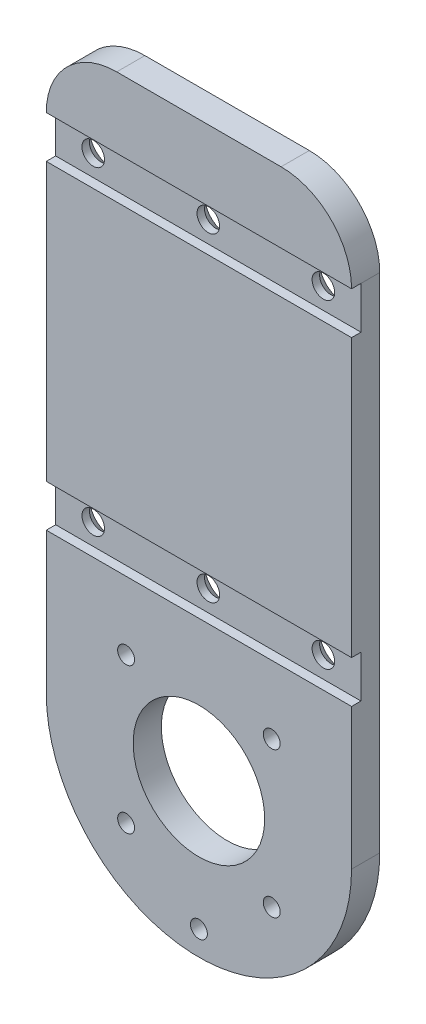
ISO-10303-21;
HEADER;
FILE_DESCRIPTION(('STEP AP214'),'2;1');
FILE_NAME('part.step','',(''),(''),'','','');
FILE_SCHEMA(('AUTOMOTIVE_DESIGN { 1 0 10303 214 1 1 1 1 }'));
ENDSEC;
DATA;
#1=APPLICATION_CONTEXT('core data for automotive mechanical design processes');
#2=APPLICATION_PROTOCOL_DEFINITION('international standard','automotive_design',2000,#1);
#3=PRODUCT_CONTEXT('',#1,'mechanical');
#4=PRODUCT('Part','Part','',(#3));
#5=PRODUCT_RELATED_PRODUCT_CATEGORY('part','',(#4));
#6=PRODUCT_DEFINITION_FORMATION('','',#4);
#7=PRODUCT_DEFINITION_CONTEXT('part definition',#1,'design');
#8=PRODUCT_DEFINITION('design','',#6,#7);
#9=PRODUCT_DEFINITION_SHAPE('','',#8);
#10=(LENGTH_UNIT() NAMED_UNIT(*) SI_UNIT(.MILLI.,.METRE.));
#11=(NAMED_UNIT(*) PLANE_ANGLE_UNIT() SI_UNIT($,.RADIAN.));
#12=(NAMED_UNIT(*) SI_UNIT($,.STERADIAN.) SOLID_ANGLE_UNIT());
#13=UNCERTAINTY_MEASURE_WITH_UNIT(LENGTH_MEASURE(1.E-05),#10,'distance_accuracy_value','');
#14=(GEOMETRIC_REPRESENTATION_CONTEXT(3) GLOBAL_UNCERTAINTY_ASSIGNED_CONTEXT((#13)) GLOBAL_UNIT_ASSIGNED_CONTEXT((#10,
#11,#12)) REPRESENTATION_CONTEXT('',''));
#15=CARTESIAN_POINT('',(0.,0.,0.));
#16=DIRECTION('',(0.,0.,1.));
#17=DIRECTION('',(1.,0.,0.));
#18=AXIS2_PLACEMENT_3D('',#15,#16,#17);
#19=CARTESIAN_POINT('',(32.5,0.,6.));
#20=DIRECTION('',(-1.,0.,0.));
#21=DIRECTION('',(0.,0.,1.));
#22=AXIS2_PLACEMENT_3D('',#19,#20,#21);
#23=PLANE('',#22);
#24=DIRECTION('',(0.,1.,0.));
#25=VECTOR('',#24,1.);
#26=CARTESIAN_POINT('',(32.5,0.,0.));
#27=LINE('',#26,#25);
#28=CARTESIAN_POINT('',(32.5,-95.,0.));
#29=VERTEX_POINT('',#28);
#30=CARTESIAN_POINT('',(32.5,12.,0.));
#31=VERTEX_POINT('',#30);
#32=EDGE_CURVE('E231',#29,#31,#27,.T.);
#33=ORIENTED_EDGE('',*,*,#32,.T.);
#34=DIRECTION('',(0.,0.,1.));
#35=VECTOR('',#34,1.);
#36=CARTESIAN_POINT('',(32.5,12.,6.));
#37=LINE('',#36,#35);
#38=CARTESIAN_POINT('',(32.5,12.,4.));
#39=VERTEX_POINT('',#38);
#40=EDGE_CURVE('E302',#31,#39,#37,.T.);
#41=ORIENTED_EDGE('',*,*,#40,.T.);
#42=DIRECTION('',(0.,1.,0.));
#43=VECTOR('',#42,1.);
#44=CARTESIAN_POINT('',(32.5,0.,4.));
#45=LINE('',#44,#43);
#46=CARTESIAN_POINT('',(32.5,2.99999999999998,4.));
#47=VERTEX_POINT('',#46);
#48=EDGE_CURVE('E153',#47,#39,#45,.T.);
#49=ORIENTED_EDGE('',*,*,#48,.F.);
#50=DIRECTION('',(0.,0.,1.));
#51=VECTOR('',#50,1.);
#52=CARTESIAN_POINT('',(32.5,2.99999999999998,4.));
#53=LINE('',#52,#51);
#54=CARTESIAN_POINT('',(32.5,2.99999999999998,6.));
#55=VERTEX_POINT('',#54);
#56=EDGE_CURVE('E149',#47,#55,#53,.T.);
#57=ORIENTED_EDGE('',*,*,#56,.T.);
#58=DIRECTION('',(0.,1.,0.));
#59=VECTOR('',#58,1.);
#60=CARTESIAN_POINT('',(32.5,0.,6.));
#61=LINE('',#60,#59);
#62=CARTESIAN_POINT('',(32.5,-56.,6.));
#63=VERTEX_POINT('',#62);
#64=EDGE_CURVE('E217',#63,#55,#61,.T.);
#65=ORIENTED_EDGE('',*,*,#64,.F.);
#66=DIRECTION('',(0.,0.,1.));
#67=VECTOR('',#66,1.);
#68=CARTESIAN_POINT('',(32.5,-56.,4.));
#69=LINE('',#68,#67);
#70=CARTESIAN_POINT('',(32.5,-56.,4.));
#71=VERTEX_POINT('',#70);
#72=EDGE_CURVE('E185',#71,#63,#69,.T.);
#73=ORIENTED_EDGE('',*,*,#72,.F.);
#74=DIRECTION('',(0.,1.,0.));
#75=VECTOR('',#74,1.);
#76=CARTESIAN_POINT('',(32.5,0.,4.));
#77=LINE('',#76,#75);
#78=CARTESIAN_POINT('',(32.5,-65.,4.));
#79=VERTEX_POINT('',#78);
#80=EDGE_CURVE('E173',#79,#71,#77,.T.);
#81=ORIENTED_EDGE('',*,*,#80,.F.);
#82=DIRECTION('',(0.,0.,1.));
#83=VECTOR('',#82,1.);
#84=CARTESIAN_POINT('',(32.5,-65.,4.));
#85=LINE('',#84,#83);
#86=CARTESIAN_POINT('',(32.5,-65.,6.));
#87=VERTEX_POINT('',#86);
#88=EDGE_CURVE('E191',#79,#87,#85,.T.);
#89=ORIENTED_EDGE('',*,*,#88,.T.);
#90=CARTESIAN_POINT('',(32.5,-95.,6.));
#91=VERTEX_POINT('',#90);
#92=EDGE_CURVE('E219',#91,#87,#61,.T.);
#93=ORIENTED_EDGE('',*,*,#92,.F.);
#94=DIRECTION('',(0.,0.,-1.));
#95=VECTOR('',#94,1.);
#96=CARTESIAN_POINT('',(32.5,-95.,6.));
#97=LINE('',#96,#95);
#98=EDGE_CURVE('E239',#91,#29,#97,.T.);
#99=ORIENTED_EDGE('',*,*,#98,.T.);
#100=EDGE_LOOP('',(#33,#41,#49,#57,#65,#73,#81,#89,#93,#99));
#101=FACE_BOUND('',#100,.T.);
#102=ADVANCED_FACE('F45',(#101),#23,.F.);
#103=CARTESIAN_POINT('',(-32.5,0.,6.));
#104=DIRECTION('',(-1.,0.,0.));
#105=DIRECTION('',(0.,0.,1.));
#106=AXIS2_PLACEMENT_3D('',#103,#104,#105);
#107=PLANE('',#106);
#108=DIRECTION('',(0.,-1.,0.));
#109=VECTOR('',#108,1.);
#110=CARTESIAN_POINT('',(-32.5,0.,4.));
#111=LINE('',#110,#109);
#112=CARTESIAN_POINT('',(-32.5,12.,4.));
#113=VERTEX_POINT('',#112);
#114=CARTESIAN_POINT('',(-32.5,2.99999999999998,4.));
#115=VERTEX_POINT('',#114);
#116=EDGE_CURVE('E154',#113,#115,#111,.T.);
#117=ORIENTED_EDGE('',*,*,#116,.F.);
#118=DIRECTION('',(0.,0.,1.));
#119=VECTOR('',#118,1.);
#120=CARTESIAN_POINT('',(-32.5,12.,0.));
#121=LINE('',#120,#119);
#122=CARTESIAN_POINT('',(-32.5,12.,0.));
#123=VERTEX_POINT('',#122);
#124=EDGE_CURVE('E11',#113,#123,#121,.F.);
#125=ORIENTED_EDGE('',*,*,#124,.T.);
#126=DIRECTION('',(0.,1.,0.));
#127=VECTOR('',#126,1.);
#128=CARTESIAN_POINT('',(-32.5,0.,0.));
#129=LINE('',#128,#127);
#130=CARTESIAN_POINT('',(-32.5,-95.,0.));
#131=VERTEX_POINT('',#130);
#132=EDGE_CURVE('E234',#131,#123,#129,.T.);
#133=ORIENTED_EDGE('',*,*,#132,.F.);
#134=DIRECTION('',(0.,0.,-1.));
#135=VECTOR('',#134,1.);
#136=CARTESIAN_POINT('',(-32.5,-95.,6.));
#137=LINE('',#136,#135);
#138=CARTESIAN_POINT('',(-32.5,-95.,6.));
#139=VERTEX_POINT('',#138);
#140=EDGE_CURVE('E228',#139,#131,#137,.T.);
#141=ORIENTED_EDGE('',*,*,#140,.F.);
#142=DIRECTION('',(0.,1.,0.));
#143=VECTOR('',#142,1.);
#144=CARTESIAN_POINT('',(-32.5,0.,6.));
#145=LINE('',#144,#143);
#146=CARTESIAN_POINT('',(-32.5,-65.,6.));
#147=VERTEX_POINT('',#146);
#148=EDGE_CURVE('E222',#139,#147,#145,.T.);
#149=ORIENTED_EDGE('',*,*,#148,.T.);
#150=DIRECTION('',(0.,0.,1.));
#151=VECTOR('',#150,1.);
#152=CARTESIAN_POINT('',(-32.5,-65.,4.));
#153=LINE('',#152,#151);
#154=CARTESIAN_POINT('',(-32.5,-65.,4.));
#155=VERTEX_POINT('',#154);
#156=EDGE_CURVE('E195',#155,#147,#153,.T.);
#157=ORIENTED_EDGE('',*,*,#156,.F.);
#158=DIRECTION('',(0.,-1.,0.));
#159=VECTOR('',#158,1.);
#160=CARTESIAN_POINT('',(-32.5,0.,4.));
#161=LINE('',#160,#159);
#162=CARTESIAN_POINT('',(-32.5,-56.,4.));
#163=VERTEX_POINT('',#162);
#164=EDGE_CURVE('E180',#163,#155,#161,.T.);
#165=ORIENTED_EDGE('',*,*,#164,.F.);
#166=DIRECTION('',(0.,0.,1.));
#167=VECTOR('',#166,1.);
#168=CARTESIAN_POINT('',(-32.5,-56.,4.));
#169=LINE('',#168,#167);
#170=CARTESIAN_POINT('',(-32.5,-56.,6.));
#171=VERTEX_POINT('',#170);
#172=EDGE_CURVE('E197',#163,#171,#169,.T.);
#173=ORIENTED_EDGE('',*,*,#172,.T.);
#174=CARTESIAN_POINT('',(-32.5,2.99999999999998,6.));
#175=VERTEX_POINT('',#174);
#176=EDGE_CURVE('E166',#171,#175,#145,.T.);
#177=ORIENTED_EDGE('',*,*,#176,.T.);
#178=DIRECTION('',(0.,0.,1.));
#179=VECTOR('',#178,1.);
#180=CARTESIAN_POINT('',(-32.5,2.99999999999998,4.));
#181=LINE('',#180,#179);
#182=EDGE_CURVE('E146',#115,#175,#181,.T.);
#183=ORIENTED_EDGE('',*,*,#182,.F.);
#184=EDGE_LOOP('',(#117,#125,#133,#141,#149,#157,#165,#173,#177,#183));
#185=FACE_BOUND('',#184,.T.);
#186=ADVANCED_FACE('F163',(#185),#107,.T.);
#187=CARTESIAN_POINT('',(0.,0.,6.));
#188=DIRECTION('',(0.,0.,1.));
#189=DIRECTION('',(1.,0.,0.));
#190=AXIS2_PLACEMENT_3D('',#187,#188,#189);
#191=PLANE('',#190);
#192=DIRECTION('',(1.,0.,0.));
#193=VECTOR('',#192,1.);
#194=CARTESIAN_POINT('',(0.,12.,6.));
#195=LINE('',#194,#193);
#196=CARTESIAN_POINT('',(-32.5,12.,6.));
#197=VERTEX_POINT('',#196);
#198=CARTESIAN_POINT('',(32.5,12.,6.));
#199=VERTEX_POINT('',#198);
#200=EDGE_CURVE('E160',#197,#199,#195,.T.);
#201=ORIENTED_EDGE('',*,*,#200,.T.);
#202=CARTESIAN_POINT('',(17.5,12.,6.));
#203=DIRECTION('',(0.,0.,1.));
#204=DIRECTION('',(1.,0.,0.));
#205=AXIS2_PLACEMENT_3D('',#202,#203,#204);
#206=CIRCLE('',#205,15.);
#207=CARTESIAN_POINT('',(17.5,27.,6.));
#208=VERTEX_POINT('',#207);
#209=EDGE_CURVE('E307',#199,#208,#206,.T.);
#210=ORIENTED_EDGE('',*,*,#209,.T.);
#211=DIRECTION('',(1.,0.,0.));
#212=VECTOR('',#211,1.);
#213=CARTESIAN_POINT('',(-32.5,27.,6.));
#214=LINE('',#213,#212);
#215=CARTESIAN_POINT('',(-17.5,27.,6.));
#216=VERTEX_POINT('',#215);
#217=EDGE_CURVE('E353',#216,#208,#214,.T.);
#218=ORIENTED_EDGE('',*,*,#217,.F.);
#219=CARTESIAN_POINT('',(-17.5,12.,6.));
#220=DIRECTION('',(0.,0.,1.));
#221=DIRECTION('',(1.,0.,0.));
#222=AXIS2_PLACEMENT_3D('',#219,#220,#221);
#223=CIRCLE('',#222,15.);
#224=EDGE_CURVE('E305',#216,#197,#223,.T.);
#225=ORIENTED_EDGE('',*,*,#224,.T.);
#226=EDGE_LOOP('',(#201,#210,#218,#225));
#227=FACE_BOUND('',#226,.T.);
#228=ADVANCED_FACE('F408',(#227),#191,.T.);
#229=CARTESIAN_POINT('',(0.,-122.3,6.));
#230=DIRECTION('',(0.,0.,1.));
#231=DIRECTION('',(1.,0.,0.));
#232=AXIS2_PLACEMENT_3D('',#229,#230,#231);
#233=CIRCLE('',#232,1.79999999999999);
#234=CARTESIAN_POINT('',(1.79999999999999,-122.3,6.));
#235=VERTEX_POINT('',#234);
#236=EDGE_CURVE('E49',#235,#235,#233,.T.);
#237=ORIENTED_EDGE('',*,*,#236,.F.);
#238=EDGE_LOOP('',(#237));
#239=FACE_BOUND('',#238,.T.);
#240=CARTESIAN_POINT('',(15.5,-110.5,6.));
#241=DIRECTION('',(0.,0.,-1.));
#242=DIRECTION('',(-1.,0.,0.));
#243=AXIS2_PLACEMENT_3D('',#240,#241,#242);
#244=CIRCLE('',#243,1.8);
#245=CARTESIAN_POINT('',(13.7,-110.5,6.));
#246=VERTEX_POINT('',#245);
#247=EDGE_CURVE('E200',#246,#246,#244,.T.);
#248=ORIENTED_EDGE('',*,*,#247,.T.);
#249=EDGE_LOOP('',(#248));
#250=FACE_BOUND('',#249,.T.);
#251=CARTESIAN_POINT('',(-15.5,-110.5,6.));
#252=DIRECTION('',(0.,0.,-1.));
#253=DIRECTION('',(-1.,0.,0.));
#254=AXIS2_PLACEMENT_3D('',#251,#252,#253);
#255=CIRCLE('',#254,1.8);
#256=CARTESIAN_POINT('',(-17.3,-110.5,6.));
#257=VERTEX_POINT('',#256);
#258=EDGE_CURVE('E203',#257,#257,#255,.T.);
#259=ORIENTED_EDGE('',*,*,#258,.T.);
#260=EDGE_LOOP('',(#259));
#261=FACE_BOUND('',#260,.T.);
#262=CARTESIAN_POINT('',(-15.5,-79.5,6.));
#263=DIRECTION('',(0.,0.,-1.));
#264=DIRECTION('',(-1.,0.,0.));
#265=AXIS2_PLACEMENT_3D('',#262,#263,#264);
#266=CIRCLE('',#265,1.8);
#267=CARTESIAN_POINT('',(-17.3,-79.5,6.));
#268=VERTEX_POINT('',#267);
#269=EDGE_CURVE('E207',#268,#268,#266,.T.);
#270=ORIENTED_EDGE('',*,*,#269,.T.);
#271=EDGE_LOOP('',(#270));
#272=FACE_BOUND('',#271,.T.);
#273=CARTESIAN_POINT('',(15.5,-79.5,6.));
#274=DIRECTION('',(0.,0.,-1.));
#275=DIRECTION('',(-1.,0.,0.));
#276=AXIS2_PLACEMENT_3D('',#273,#274,#275);
#277=CIRCLE('',#276,1.8);
#278=CARTESIAN_POINT('',(13.7,-79.5,6.));
#279=VERTEX_POINT('',#278);
#280=EDGE_CURVE('E210',#279,#279,#277,.T.);
#281=ORIENTED_EDGE('',*,*,#280,.T.);
#282=EDGE_LOOP('',(#281));
#283=FACE_BOUND('',#282,.T.);
#284=CARTESIAN_POINT('',(0.,-95.,6.));
#285=DIRECTION('',(0.,0.,1.));
#286=DIRECTION('',(1.,0.,0.));
#287=AXIS2_PLACEMENT_3D('',#284,#285,#286);
#288=CIRCLE('',#287,14.);
#289=CARTESIAN_POINT('',(14.,-95.,6.));
#290=VERTEX_POINT('',#289);
#291=EDGE_CURVE('E225',#290,#290,#288,.T.);
#292=ORIENTED_EDGE('',*,*,#291,.F.);
#293=EDGE_LOOP('',(#292));
#294=FACE_BOUND('',#293,.T.);
#295=ORIENTED_EDGE('',*,*,#92,.T.);
#296=DIRECTION('',(-1.,0.,0.));
#297=VECTOR('',#296,1.);
#298=CARTESIAN_POINT('',(0.,-65.,6.));
#299=LINE('',#298,#297);
#300=EDGE_CURVE('E177',#87,#147,#299,.T.);
#301=ORIENTED_EDGE('',*,*,#300,.T.);
#302=ORIENTED_EDGE('',*,*,#148,.F.);
#303=CARTESIAN_POINT('',(0.,-95.,6.));
#304=DIRECTION('',(0.,0.,1.));
#305=DIRECTION('',(1.,0.,0.));
#306=AXIS2_PLACEMENT_3D('',#303,#304,#305);
#307=CIRCLE('',#306,32.5);
#308=EDGE_CURVE('E214',#139,#91,#307,.T.);
#309=ORIENTED_EDGE('',*,*,#308,.T.);
#310=EDGE_LOOP('',(#295,#301,#302,#309));
#311=FACE_BOUND('',#310,.T.);
#312=ADVANCED_FACE('F404',(#239,#250,#261,#272,#283,#294,#311),#191,.T.);
#313=CARTESIAN_POINT('',(0.,-95.,6.));
#314=DIRECTION('',(0.,0.,-1.));
#315=DIRECTION('',(-1.,0.,0.));
#316=AXIS2_PLACEMENT_3D('',#313,#314,#315);
#317=CYLINDRICAL_SURFACE('',#316,32.5);
#318=CARTESIAN_POINT('',(0.,-95.,0.));
#319=DIRECTION('',(0.,0.,1.));
#320=DIRECTION('',(1.,0.,0.));
#321=AXIS2_PLACEMENT_3D('',#318,#319,#320);
#322=CIRCLE('',#321,32.5);
#323=EDGE_CURVE('E213',#131,#29,#322,.T.);
#324=ORIENTED_EDGE('',*,*,#323,.T.);
#325=ORIENTED_EDGE('',*,*,#98,.F.);
#326=ORIENTED_EDGE('',*,*,#308,.F.);
#327=ORIENTED_EDGE('',*,*,#140,.T.);
#328=EDGE_LOOP('',(#324,#325,#326,#327));
#329=FACE_BOUND('',#328,.T.);
#330=ADVANCED_FACE('F407',(#329),#317,.T.);
#331=CARTESIAN_POINT('',(0.,-95.,6.));
#332=DIRECTION('',(0.,0.,-1.));
#333=DIRECTION('',(-1.,0.,0.));
#334=AXIS2_PLACEMENT_3D('',#331,#332,#333);
#335=CYLINDRICAL_SURFACE('',#334,14.);
#336=ORIENTED_EDGE('',*,*,#291,.T.);
#337=EDGE_LOOP('',(#336));
#338=FACE_BOUND('',#337,.T.);
#339=CARTESIAN_POINT('',(0.,-95.,0.));
#340=DIRECTION('',(0.,0.,1.));
#341=DIRECTION('',(1.,0.,0.));
#342=AXIS2_PLACEMENT_3D('',#339,#340,#341);
#343=CIRCLE('',#342,14.);
#344=CARTESIAN_POINT('',(14.,-95.,0.));
#345=VERTEX_POINT('',#344);
#346=EDGE_CURVE('E218',#345,#345,#343,.T.);
#347=ORIENTED_EDGE('',*,*,#346,.F.);
#348=EDGE_LOOP('',(#347));
#349=FACE_BOUND('',#348,.T.);
#350=ADVANCED_FACE('F458',(#338,#349),#335,.F.);
#351=DIRECTION('',(1.,0.,0.));
#352=VECTOR('',#351,1.);
#353=CARTESIAN_POINT('',(0.,2.99999999999998,6.));
#354=LINE('',#353,#352);
#355=EDGE_CURVE('E194',#175,#55,#354,.T.);
#356=ORIENTED_EDGE('',*,*,#355,.F.);
#357=ORIENTED_EDGE('',*,*,#176,.F.);
#358=DIRECTION('',(-1.,0.,0.));
#359=VECTOR('',#358,1.);
#360=CARTESIAN_POINT('',(0.,-56.,6.));
#361=LINE('',#360,#359);
#362=EDGE_CURVE('E186',#63,#171,#361,.T.);
#363=ORIENTED_EDGE('',*,*,#362,.F.);
#364=ORIENTED_EDGE('',*,*,#64,.T.);
#365=EDGE_LOOP('',(#356,#357,#363,#364));
#366=FACE_BOUND('',#365,.T.);
#367=ADVANCED_FACE('F368',(#366),#191,.T.);
#368=CARTESIAN_POINT('',(0.,0.,0.));
#369=DIRECTION('',(0.,0.,1.));
#370=DIRECTION('',(1.,0.,0.));
#371=AXIS2_PLACEMENT_3D('',#368,#369,#370);
#372=PLANE('',#371);
#373=CARTESIAN_POINT('',(0.,-122.3,0.));
#374=DIRECTION('',(0.,0.,-1.));
#375=DIRECTION('',(-1.,0.,0.));
#376=AXIS2_PLACEMENT_3D('',#373,#374,#375);
#377=CIRCLE('',#376,3.15);
#378=CARTESIAN_POINT('',(-3.15,-122.3,0.));
#379=VERTEX_POINT('',#378);
#380=EDGE_CURVE('E359',#379,#379,#377,.T.);
#381=ORIENTED_EDGE('',*,*,#380,.F.);
#382=EDGE_LOOP('',(#381));
#383=FACE_BOUND('',#382,.T.);
#384=CARTESIAN_POINT('',(24.5,7.49999999999999,0.));
#385=DIRECTION('',(0.,0.,1.));
#386=DIRECTION('',(1.,0.,0.));
#387=AXIS2_PLACEMENT_3D('',#384,#385,#386);
#388=CIRCLE('',#387,4.80000000000003);
#389=CARTESIAN_POINT('',(29.3,7.49999999999999,0.));
#390=VERTEX_POINT('',#389);
#391=EDGE_CURVE('E269',#390,#390,#388,.T.);
#392=ORIENTED_EDGE('',*,*,#391,.T.);
#393=EDGE_LOOP('',(#392));
#394=FACE_BOUND('',#393,.T.);
#395=CARTESIAN_POINT('',(0.,7.5,0.));
#396=DIRECTION('',(0.,0.,1.));
#397=DIRECTION('',(1.,0.,0.));
#398=AXIS2_PLACEMENT_3D('',#395,#396,#397);
#399=CIRCLE('',#398,4.80000000000003);
#400=CARTESIAN_POINT('',(4.80000000000003,7.5,0.));
#401=VERTEX_POINT('',#400);
#402=EDGE_CURVE('E266',#401,#401,#399,.T.);
#403=ORIENTED_EDGE('',*,*,#402,.T.);
#404=EDGE_LOOP('',(#403));
#405=FACE_BOUND('',#404,.T.);
#406=CARTESIAN_POINT('',(-24.5,7.5,0.));
#407=DIRECTION('',(0.,0.,1.));
#408=DIRECTION('',(1.,0.,0.));
#409=AXIS2_PLACEMENT_3D('',#406,#407,#408);
#410=CIRCLE('',#409,4.80000000000003);
#411=CARTESIAN_POINT('',(-19.7,7.5,0.));
#412=VERTEX_POINT('',#411);
#413=EDGE_CURVE('E263',#412,#412,#410,.T.);
#414=ORIENTED_EDGE('',*,*,#413,.T.);
#415=EDGE_LOOP('',(#414));
#416=FACE_BOUND('',#415,.T.);
#417=CARTESIAN_POINT('',(-24.5,-60.5,0.));
#418=DIRECTION('',(0.,0.,1.));
#419=DIRECTION('',(1.,0.,0.));
#420=AXIS2_PLACEMENT_3D('',#417,#418,#419);
#421=CIRCLE('',#420,4.80000000000003);
#422=CARTESIAN_POINT('',(-19.7,-60.5,0.));
#423=VERTEX_POINT('',#422);
#424=EDGE_CURVE('E260',#423,#423,#421,.T.);
#425=ORIENTED_EDGE('',*,*,#424,.T.);
#426=EDGE_LOOP('',(#425));
#427=FACE_BOUND('',#426,.T.);
#428=CARTESIAN_POINT('',(0.,-60.5,0.));
#429=DIRECTION('',(0.,0.,1.));
#430=DIRECTION('',(1.,0.,0.));
#431=AXIS2_PLACEMENT_3D('',#428,#429,#430);
#432=CIRCLE('',#431,4.80000000000003);
#433=CARTESIAN_POINT('',(4.80000000000003,-60.5,0.));
#434=VERTEX_POINT('',#433);
#435=EDGE_CURVE('E257',#434,#434,#432,.T.);
#436=ORIENTED_EDGE('',*,*,#435,.T.);
#437=EDGE_LOOP('',(#436));
#438=FACE_BOUND('',#437,.T.);
#439=CARTESIAN_POINT('',(24.5,-60.5,0.));
#440=DIRECTION('',(0.,0.,1.));
#441=DIRECTION('',(1.,0.,0.));
#442=AXIS2_PLACEMENT_3D('',#439,#440,#441);
#443=CIRCLE('',#442,4.80000000000003);
#444=CARTESIAN_POINT('',(29.3,-60.5,0.));
#445=VERTEX_POINT('',#444);
#446=EDGE_CURVE('E254',#445,#445,#443,.T.);
#447=ORIENTED_EDGE('',*,*,#446,.T.);
#448=EDGE_LOOP('',(#447));
#449=FACE_BOUND('',#448,.T.);
#450=CARTESIAN_POINT('',(15.5,-110.5,0.));
#451=DIRECTION('',(0.,0.,1.));
#452=DIRECTION('',(1.,0.,0.));
#453=AXIS2_PLACEMENT_3D('',#450,#451,#452);
#454=CIRCLE('',#453,4.20000000000001);
#455=CARTESIAN_POINT('',(19.7,-110.5,0.));
#456=VERTEX_POINT('',#455);
#457=EDGE_CURVE('E251',#456,#456,#454,.T.);
#458=ORIENTED_EDGE('',*,*,#457,.T.);
#459=EDGE_LOOP('',(#458));
#460=FACE_BOUND('',#459,.T.);
#461=CARTESIAN_POINT('',(-15.5,-110.5,0.));
#462=DIRECTION('',(0.,0.,1.));
#463=DIRECTION('',(1.,0.,0.));
#464=AXIS2_PLACEMENT_3D('',#461,#462,#463);
#465=CIRCLE('',#464,4.19999999999995);
#466=CARTESIAN_POINT('',(-11.3,-110.5,0.));
#467=VERTEX_POINT('',#466);
#468=EDGE_CURVE('E248',#467,#467,#465,.T.);
#469=ORIENTED_EDGE('',*,*,#468,.T.);
#470=EDGE_LOOP('',(#469));
#471=FACE_BOUND('',#470,.T.);
#472=CARTESIAN_POINT('',(-15.5,-79.5,0.));
#473=DIRECTION('',(0.,0.,1.));
#474=DIRECTION('',(1.,0.,0.));
#475=AXIS2_PLACEMENT_3D('',#472,#473,#474);
#476=CIRCLE('',#475,4.19999999999995);
#477=CARTESIAN_POINT('',(-11.3,-79.5,0.));
#478=VERTEX_POINT('',#477);
#479=EDGE_CURVE('E245',#478,#478,#476,.T.);
#480=ORIENTED_EDGE('',*,*,#479,.T.);
#481=EDGE_LOOP('',(#480));
#482=FACE_BOUND('',#481,.T.);
#483=CARTESIAN_POINT('',(15.5,-79.5,0.));
#484=DIRECTION('',(0.,0.,1.));
#485=DIRECTION('',(1.,0.,0.));
#486=AXIS2_PLACEMENT_3D('',#483,#484,#485);
#487=CIRCLE('',#486,4.20000000000001);
#488=CARTESIAN_POINT('',(19.7,-79.5,0.));
#489=VERTEX_POINT('',#488);
#490=EDGE_CURVE('E242',#489,#489,#487,.T.);
#491=ORIENTED_EDGE('',*,*,#490,.T.);
#492=EDGE_LOOP('',(#491));
#493=FACE_BOUND('',#492,.T.);
#494=DIRECTION('',(1.,0.,0.));
#495=VECTOR('',#494,1.);
#496=CARTESIAN_POINT('',(-32.5,27.,0.));
#497=LINE('',#496,#495);
#498=CARTESIAN_POINT('',(-17.5,27.,0.));
#499=VERTEX_POINT('',#498);
#500=CARTESIAN_POINT('',(17.5,27.,0.));
#501=VERTEX_POINT('',#500);
#502=EDGE_CURVE('E320',#499,#501,#497,.T.);
#503=ORIENTED_EDGE('',*,*,#502,.T.);
#504=CARTESIAN_POINT('',(17.5,12.,0.));
#505=DIRECTION('',(0.,0.,1.));
#506=DIRECTION('',(1.,0.,0.));
#507=AXIS2_PLACEMENT_3D('',#504,#505,#506);
#508=CIRCLE('',#507,15.);
#509=EDGE_CURVE('E54',#501,#31,#508,.F.);
#510=ORIENTED_EDGE('',*,*,#509,.T.);
#511=ORIENTED_EDGE('',*,*,#32,.F.);
#512=ORIENTED_EDGE('',*,*,#323,.F.);
#513=ORIENTED_EDGE('',*,*,#132,.T.);
#514=CARTESIAN_POINT('',(-17.5,12.,0.));
#515=DIRECTION('',(0.,0.,1.));
#516=DIRECTION('',(1.,0.,0.));
#517=AXIS2_PLACEMENT_3D('',#514,#515,#516);
#518=CIRCLE('',#517,15.);
#519=EDGE_CURVE('E313',#123,#499,#518,.F.);
#520=ORIENTED_EDGE('',*,*,#519,.T.);
#521=EDGE_LOOP('',(#503,#510,#511,#512,#513,#520));
#522=FACE_BOUND('',#521,.T.);
#523=ORIENTED_EDGE('',*,*,#346,.T.);
#524=EDGE_LOOP('',(#523));
#525=FACE_BOUND('',#524,.T.);
#526=ADVANCED_FACE('F317',(#383,#394,#405,#416,#427,#438,#449,#460,#471,#482,#493,#522,#525),
#372,.F.);
#527=CARTESIAN_POINT('',(15.5,-79.5,0.));
#528=DIRECTION('',(0.,0.,-1.));
#529=DIRECTION('',(-1.,0.,0.));
#530=AXIS2_PLACEMENT_3D('',#527,#528,#529);
#531=CYLINDRICAL_SURFACE('',#530,1.8);
#532=CARTESIAN_POINT('',(15.5,-79.5,2.40000000000001));
#533=DIRECTION('',(0.,0.,1.));
#534=DIRECTION('',(1.,0.,0.));
#535=AXIS2_PLACEMENT_3D('',#532,#533,#534);
#536=CIRCLE('',#535,1.8);
#537=CARTESIAN_POINT('',(17.3,-79.5,2.40000000000001));
#538=VERTEX_POINT('',#537);
#539=EDGE_CURVE('E299',#538,#538,#536,.F.);
#540=ORIENTED_EDGE('',*,*,#539,.T.);
#541=EDGE_LOOP('',(#540));
#542=FACE_BOUND('',#541,.T.);
#543=ORIENTED_EDGE('',*,*,#280,.F.);
#544=EDGE_LOOP('',(#543));
#545=FACE_BOUND('',#544,.T.);
#546=ADVANCED_FACE('F367',(#542,#545),#531,.F.);
#547=CARTESIAN_POINT('',(-15.5,-79.5,0.));
#548=DIRECTION('',(0.,0.,-1.));
#549=DIRECTION('',(-1.,0.,0.));
#550=AXIS2_PLACEMENT_3D('',#547,#548,#549);
#551=CYLINDRICAL_SURFACE('',#550,1.8);
#552=CARTESIAN_POINT('',(-15.5,-79.5,2.39999999999995));
#553=DIRECTION('',(0.,0.,1.));
#554=DIRECTION('',(1.,0.,0.));
#555=AXIS2_PLACEMENT_3D('',#552,#553,#554);
#556=CIRCLE('',#555,1.8);
#557=CARTESIAN_POINT('',(-13.7,-79.5,2.39999999999995));
#558=VERTEX_POINT('',#557);
#559=EDGE_CURVE('E296',#558,#558,#556,.F.);
#560=ORIENTED_EDGE('',*,*,#559,.T.);
#561=EDGE_LOOP('',(#560));
#562=FACE_BOUND('',#561,.T.);
#563=ORIENTED_EDGE('',*,*,#269,.F.);
#564=EDGE_LOOP('',(#563));
#565=FACE_BOUND('',#564,.T.);
#566=ADVANCED_FACE('F400',(#562,#565),#551,.F.);
#567=CARTESIAN_POINT('',(-15.5,-110.5,0.));
#568=DIRECTION('',(0.,0.,-1.));
#569=DIRECTION('',(-1.,0.,0.));
#570=AXIS2_PLACEMENT_3D('',#567,#568,#569);
#571=CYLINDRICAL_SURFACE('',#570,1.8);
#572=CARTESIAN_POINT('',(-15.5,-110.5,2.39999999999995));
#573=DIRECTION('',(0.,0.,1.));
#574=DIRECTION('',(1.,0.,0.));
#575=AXIS2_PLACEMENT_3D('',#572,#573,#574);
#576=CIRCLE('',#575,1.8);
#577=CARTESIAN_POINT('',(-13.7,-110.5,2.39999999999995));
#578=VERTEX_POINT('',#577);
#579=EDGE_CURVE('E293',#578,#578,#576,.F.);
#580=ORIENTED_EDGE('',*,*,#579,.T.);
#581=EDGE_LOOP('',(#580));
#582=FACE_BOUND('',#581,.T.);
#583=ORIENTED_EDGE('',*,*,#258,.F.);
#584=EDGE_LOOP('',(#583));
#585=FACE_BOUND('',#584,.T.);
#586=ADVANCED_FACE('F838',(#582,#585),#571,.F.);
#587=CARTESIAN_POINT('',(15.5,-110.5,0.));
#588=DIRECTION('',(0.,0.,-1.));
#589=DIRECTION('',(-1.,0.,0.));
#590=AXIS2_PLACEMENT_3D('',#587,#588,#589);
#591=CYLINDRICAL_SURFACE('',#590,1.8);
#592=CARTESIAN_POINT('',(15.5,-110.5,2.40000000000001));
#593=DIRECTION('',(0.,0.,1.));
#594=DIRECTION('',(1.,0.,0.));
#595=AXIS2_PLACEMENT_3D('',#592,#593,#594);
#596=CIRCLE('',#595,1.8);
#597=CARTESIAN_POINT('',(17.3,-110.5,2.40000000000001));
#598=VERTEX_POINT('',#597);
#599=EDGE_CURVE('E290',#598,#598,#596,.F.);
#600=ORIENTED_EDGE('',*,*,#599,.T.);
#601=EDGE_LOOP('',(#600));
#602=FACE_BOUND('',#601,.T.);
#603=ORIENTED_EDGE('',*,*,#247,.F.);
#604=EDGE_LOOP('',(#603));
#605=FACE_BOUND('',#604,.T.);
#606=ADVANCED_FACE('F445',(#602,#605),#591,.F.);
#607=CARTESIAN_POINT('',(0.,-65.,4.));
#608=DIRECTION('',(0.,1.,0.));
#609=DIRECTION('',(-1.,0.,0.));
#610=AXIS2_PLACEMENT_3D('',#607,#608,#609);
#611=PLANE('',#610);
#612=ORIENTED_EDGE('',*,*,#300,.F.);
#613=ORIENTED_EDGE('',*,*,#88,.F.);
#614=DIRECTION('',(-1.,0.,0.));
#615=VECTOR('',#614,1.);
#616=CARTESIAN_POINT('',(0.,-65.,4.));
#617=LINE('',#616,#615);
#618=EDGE_CURVE('E183',#79,#155,#617,.T.);
#619=ORIENTED_EDGE('',*,*,#618,.T.);
#620=ORIENTED_EDGE('',*,*,#156,.T.);
#621=EDGE_LOOP('',(#612,#613,#619,#620));
#622=FACE_BOUND('',#621,.T.);
#623=ADVANCED_FACE('F419',(#622),#611,.T.);
#624=CARTESIAN_POINT('',(0.,-56.,4.));
#625=DIRECTION('',(0.,1.,0.));
#626=DIRECTION('',(-1.,0.,0.));
#627=AXIS2_PLACEMENT_3D('',#624,#625,#626);
#628=PLANE('',#627);
#629=ORIENTED_EDGE('',*,*,#362,.T.);
#630=ORIENTED_EDGE('',*,*,#172,.F.);
#631=DIRECTION('',(-1.,0.,0.));
#632=VECTOR('',#631,1.);
#633=CARTESIAN_POINT('',(0.,-56.,4.));
#634=LINE('',#633,#632);
#635=EDGE_CURVE('E176',#71,#163,#634,.T.);
#636=ORIENTED_EDGE('',*,*,#635,.F.);
#637=ORIENTED_EDGE('',*,*,#72,.T.);
#638=EDGE_LOOP('',(#629,#630,#636,#637));
#639=FACE_BOUND('',#638,.T.);
#640=ADVANCED_FACE('F436',(#639),#628,.F.);
#641=CARTESIAN_POINT('',(0.,0.,4.));
#642=DIRECTION('',(0.,0.,1.));
#643=DIRECTION('',(1.,0.,0.));
#644=AXIS2_PLACEMENT_3D('',#641,#642,#643);
#645=PLANE('',#644);
#646=CARTESIAN_POINT('',(24.5,-60.5,4.));
#647=DIRECTION('',(0.,0.,1.));
#648=DIRECTION('',(1.,0.,0.));
#649=AXIS2_PLACEMENT_3D('',#646,#647,#648);
#650=CIRCLE('',#649,2.4);
#651=CARTESIAN_POINT('',(26.9,-60.5,4.));
#652=VERTEX_POINT('',#651);
#653=EDGE_CURVE('E341',#652,#652,#650,.T.);
#654=ORIENTED_EDGE('',*,*,#653,.F.);
#655=EDGE_LOOP('',(#654));
#656=FACE_BOUND('',#655,.T.);
#657=CARTESIAN_POINT('',(0.,-60.5,4.));
#658=DIRECTION('',(0.,0.,1.));
#659=DIRECTION('',(1.,0.,0.));
#660=AXIS2_PLACEMENT_3D('',#657,#658,#659);
#661=CIRCLE('',#660,2.4);
#662=CARTESIAN_POINT('',(2.4,-60.5,4.));
#663=VERTEX_POINT('',#662);
#664=EDGE_CURVE('E338',#663,#663,#661,.T.);
#665=ORIENTED_EDGE('',*,*,#664,.F.);
#666=EDGE_LOOP('',(#665));
#667=FACE_BOUND('',#666,.T.);
#668=CARTESIAN_POINT('',(-24.5,-60.5,4.));
#669=DIRECTION('',(0.,0.,1.));
#670=DIRECTION('',(1.,0.,0.));
#671=AXIS2_PLACEMENT_3D('',#668,#669,#670);
#672=CIRCLE('',#671,2.4);
#673=CARTESIAN_POINT('',(-22.1,-60.5,4.));
#674=VERTEX_POINT('',#673);
#675=EDGE_CURVE('E188',#674,#674,#672,.T.);
#676=ORIENTED_EDGE('',*,*,#675,.F.);
#677=EDGE_LOOP('',(#676));
#678=FACE_BOUND('',#677,.T.);
#679=ORIENTED_EDGE('',*,*,#80,.T.);
#680=ORIENTED_EDGE('',*,*,#635,.T.);
#681=ORIENTED_EDGE('',*,*,#164,.T.);
#682=ORIENTED_EDGE('',*,*,#618,.F.);
#683=EDGE_LOOP('',(#679,#680,#681,#682));
#684=FACE_BOUND('',#683,.T.);
#685=ADVANCED_FACE('F421',(#656,#667,#678,#684),#645,.T.);
#686=CARTESIAN_POINT('',(0.,12.,4.));
#687=DIRECTION('',(0.,-1.,0.));
#688=DIRECTION('',(1.,0.,0.));
#689=AXIS2_PLACEMENT_3D('',#686,#687,#688);
#690=PLANE('',#689);
#691=ORIENTED_EDGE('',*,*,#200,.F.);
#692=DIRECTION('',(0.,0.,1.));
#693=VECTOR('',#692,1.);
#694=CARTESIAN_POINT('',(-32.5,12.,4.));
#695=LINE('',#694,#693);
#696=EDGE_CURVE('E204',#113,#197,#695,.T.);
#697=ORIENTED_EDGE('',*,*,#696,.F.);
#698=DIRECTION('',(1.,0.,0.));
#699=VECTOR('',#698,1.);
#700=CARTESIAN_POINT('',(0.,12.,4.));
#701=LINE('',#700,#699);
#702=EDGE_CURVE('E159',#113,#39,#701,.T.);
#703=ORIENTED_EDGE('',*,*,#702,.T.);
#704=DIRECTION('',(0.,0.,1.));
#705=VECTOR('',#704,1.);
#706=CARTESIAN_POINT('',(32.5,12.,4.));
#707=LINE('',#706,#705);
#708=EDGE_CURVE('E168',#39,#199,#707,.T.);
#709=ORIENTED_EDGE('',*,*,#708,.T.);
#710=EDGE_LOOP('',(#691,#697,#703,#709));
#711=FACE_BOUND('',#710,.T.);
#712=ADVANCED_FACE('F430',(#711),#690,.T.);
#713=CARTESIAN_POINT('',(0.,2.99999999999998,4.));
#714=DIRECTION('',(0.,-1.,0.));
#715=DIRECTION('',(1.,0.,0.));
#716=AXIS2_PLACEMENT_3D('',#713,#714,#715);
#717=PLANE('',#716);
#718=ORIENTED_EDGE('',*,*,#355,.T.);
#719=ORIENTED_EDGE('',*,*,#56,.F.);
#720=DIRECTION('',(1.,0.,0.));
#721=VECTOR('',#720,1.);
#722=CARTESIAN_POINT('',(0.,2.99999999999998,4.));
#723=LINE('',#722,#721);
#724=EDGE_CURVE('E142',#115,#47,#723,.T.);
#725=ORIENTED_EDGE('',*,*,#724,.F.);
#726=ORIENTED_EDGE('',*,*,#182,.T.);
#727=EDGE_LOOP('',(#718,#719,#725,#726));
#728=FACE_BOUND('',#727,.T.);
#729=ADVANCED_FACE('F144',(#728),#717,.F.);
#730=CARTESIAN_POINT('',(0.,0.,4.));
#731=DIRECTION('',(0.,0.,1.));
#732=DIRECTION('',(1.,0.,0.));
#733=AXIS2_PLACEMENT_3D('',#730,#731,#732);
#734=PLANE('',#733);
#735=CARTESIAN_POINT('',(-24.5,7.5,4.));
#736=DIRECTION('',(0.,0.,1.));
#737=DIRECTION('',(1.,0.,0.));
#738=AXIS2_PLACEMENT_3D('',#735,#736,#737);
#739=CIRCLE('',#738,2.4);
#740=CARTESIAN_POINT('',(-22.1,7.5,4.));
#741=VERTEX_POINT('',#740);
#742=EDGE_CURVE('E350',#741,#741,#739,.T.);
#743=ORIENTED_EDGE('',*,*,#742,.F.);
#744=EDGE_LOOP('',(#743));
#745=FACE_BOUND('',#744,.T.);
#746=CARTESIAN_POINT('',(0.,7.5,4.));
#747=DIRECTION('',(0.,0.,1.));
#748=DIRECTION('',(1.,0.,0.));
#749=AXIS2_PLACEMENT_3D('',#746,#747,#748);
#750=CIRCLE('',#749,2.4);
#751=CARTESIAN_POINT('',(2.4,7.5,4.));
#752=VERTEX_POINT('',#751);
#753=EDGE_CURVE('E347',#752,#752,#750,.T.);
#754=ORIENTED_EDGE('',*,*,#753,.F.);
#755=EDGE_LOOP('',(#754));
#756=FACE_BOUND('',#755,.T.);
#757=CARTESIAN_POINT('',(24.5,7.49999999999999,4.));
#758=DIRECTION('',(0.,0.,1.));
#759=DIRECTION('',(1.,0.,0.));
#760=AXIS2_PLACEMENT_3D('',#757,#758,#759);
#761=CIRCLE('',#760,2.4);
#762=CARTESIAN_POINT('',(26.9,7.49999999999999,4.));
#763=VERTEX_POINT('',#762);
#764=EDGE_CURVE('E344',#763,#763,#761,.T.);
#765=ORIENTED_EDGE('',*,*,#764,.F.);
#766=EDGE_LOOP('',(#765));
#767=FACE_BOUND('',#766,.T.);
#768=ORIENTED_EDGE('',*,*,#116,.T.);
#769=ORIENTED_EDGE('',*,*,#724,.T.);
#770=ORIENTED_EDGE('',*,*,#48,.T.);
#771=ORIENTED_EDGE('',*,*,#702,.F.);
#772=EDGE_LOOP('',(#768,#769,#770,#771));
#773=FACE_BOUND('',#772,.T.);
#774=ADVANCED_FACE('F157',(#745,#756,#767,#773),#734,.T.);
#775=CARTESIAN_POINT('',(-24.5,-60.5,4.));
#776=DIRECTION('',(0.,0.,1.));
#777=DIRECTION('',(1.,0.,0.));
#778=AXIS2_PLACEMENT_3D('',#775,#776,#777);
#779=CYLINDRICAL_SURFACE('',#778,2.4);
#780=CARTESIAN_POINT('',(-24.5,-60.5,2.40000000000003));
#781=DIRECTION('',(0.,0.,1.));
#782=DIRECTION('',(1.,0.,0.));
#783=AXIS2_PLACEMENT_3D('',#780,#781,#782);
#784=CIRCLE('',#783,2.4);
#785=CARTESIAN_POINT('',(-22.1,-60.5,2.40000000000003));
#786=VERTEX_POINT('',#785);
#787=EDGE_CURVE('E281',#786,#786,#784,.F.);
#788=ORIENTED_EDGE('',*,*,#787,.T.);
#789=EDGE_LOOP('',(#788));
#790=FACE_BOUND('',#789,.T.);
#791=ORIENTED_EDGE('',*,*,#675,.T.);
#792=EDGE_LOOP('',(#791));
#793=FACE_BOUND('',#792,.T.);
#794=ADVANCED_FACE('F554',(#790,#793),#779,.F.);
#795=CARTESIAN_POINT('',(0.,-60.5,4.));
#796=DIRECTION('',(0.,0.,1.));
#797=DIRECTION('',(1.,0.,0.));
#798=AXIS2_PLACEMENT_3D('',#795,#796,#797);
#799=CYLINDRICAL_SURFACE('',#798,2.4);
#800=CARTESIAN_POINT('',(0.,-60.5,2.40000000000003));
#801=DIRECTION('',(0.,0.,1.));
#802=DIRECTION('',(1.,0.,0.));
#803=AXIS2_PLACEMENT_3D('',#800,#801,#802);
#804=CIRCLE('',#803,2.4);
#805=CARTESIAN_POINT('',(2.4,-60.5,2.40000000000003));
#806=VERTEX_POINT('',#805);
#807=EDGE_CURVE('E284',#806,#806,#804,.F.);
#808=ORIENTED_EDGE('',*,*,#807,.T.);
#809=EDGE_LOOP('',(#808));
#810=FACE_BOUND('',#809,.T.);
#811=ORIENTED_EDGE('',*,*,#664,.T.);
#812=EDGE_LOOP('',(#811));
#813=FACE_BOUND('',#812,.T.);
#814=ADVANCED_FACE('F550',(#810,#813),#799,.F.);
#815=CARTESIAN_POINT('',(24.5,-60.5,4.));
#816=DIRECTION('',(0.,0.,1.));
#817=DIRECTION('',(1.,0.,0.));
#818=AXIS2_PLACEMENT_3D('',#815,#816,#817);
#819=CYLINDRICAL_SURFACE('',#818,2.4);
#820=CARTESIAN_POINT('',(24.5,-60.5,2.40000000000003));
#821=DIRECTION('',(0.,0.,1.));
#822=DIRECTION('',(1.,0.,0.));
#823=AXIS2_PLACEMENT_3D('',#820,#821,#822);
#824=CIRCLE('',#823,2.4);
#825=CARTESIAN_POINT('',(26.9,-60.5,2.40000000000003));
#826=VERTEX_POINT('',#825);
#827=EDGE_CURVE('E287',#826,#826,#824,.F.);
#828=ORIENTED_EDGE('',*,*,#827,.T.);
#829=EDGE_LOOP('',(#828));
#830=FACE_BOUND('',#829,.T.);
#831=ORIENTED_EDGE('',*,*,#653,.T.);
#832=EDGE_LOOP('',(#831));
#833=FACE_BOUND('',#832,.T.);
#834=ADVANCED_FACE('F546',(#830,#833),#819,.F.);
#835=CARTESIAN_POINT('',(24.5,7.49999999999999,4.));
#836=DIRECTION('',(0.,0.,1.));
#837=DIRECTION('',(1.,0.,0.));
#838=AXIS2_PLACEMENT_3D('',#835,#836,#837);
#839=CYLINDRICAL_SURFACE('',#838,2.4);
#840=CARTESIAN_POINT('',(24.5,7.49999999999999,2.40000000000003));
#841=DIRECTION('',(0.,0.,1.));
#842=DIRECTION('',(1.,0.,0.));
#843=AXIS2_PLACEMENT_3D('',#840,#841,#842);
#844=CIRCLE('',#843,2.4);
#845=CARTESIAN_POINT('',(26.9,7.49999999999999,2.40000000000003));
#846=VERTEX_POINT('',#845);
#847=EDGE_CURVE('E272',#846,#846,#844,.F.);
#848=ORIENTED_EDGE('',*,*,#847,.T.);
#849=EDGE_LOOP('',(#848));
#850=FACE_BOUND('',#849,.T.);
#851=ORIENTED_EDGE('',*,*,#764,.T.);
#852=EDGE_LOOP('',(#851));
#853=FACE_BOUND('',#852,.T.);
#854=ADVANCED_FACE('F542',(#850,#853),#839,.F.);
#855=CARTESIAN_POINT('',(0.,7.5,4.));
#856=DIRECTION('',(0.,0.,1.));
#857=DIRECTION('',(1.,0.,0.));
#858=AXIS2_PLACEMENT_3D('',#855,#856,#857);
#859=CYLINDRICAL_SURFACE('',#858,2.4);
#860=CARTESIAN_POINT('',(0.,7.5,2.40000000000003));
#861=DIRECTION('',(0.,0.,1.));
#862=DIRECTION('',(1.,0.,0.));
#863=AXIS2_PLACEMENT_3D('',#860,#861,#862);
#864=CIRCLE('',#863,2.4);
#865=CARTESIAN_POINT('',(2.4,7.5,2.40000000000003));
#866=VERTEX_POINT('',#865);
#867=EDGE_CURVE('E275',#866,#866,#864,.F.);
#868=ORIENTED_EDGE('',*,*,#867,.T.);
#869=EDGE_LOOP('',(#868));
#870=FACE_BOUND('',#869,.T.);
#871=ORIENTED_EDGE('',*,*,#753,.T.);
#872=EDGE_LOOP('',(#871));
#873=FACE_BOUND('',#872,.T.);
#874=ADVANCED_FACE('F538',(#870,#873),#859,.F.);
#875=CARTESIAN_POINT('',(-24.5,7.5,4.));
#876=DIRECTION('',(0.,0.,1.));
#877=DIRECTION('',(1.,0.,0.));
#878=AXIS2_PLACEMENT_3D('',#875,#876,#877);
#879=CYLINDRICAL_SURFACE('',#878,2.4);
#880=CARTESIAN_POINT('',(-24.5,7.5,2.40000000000003));
#881=DIRECTION('',(0.,0.,1.));
#882=DIRECTION('',(1.,0.,0.));
#883=AXIS2_PLACEMENT_3D('',#880,#881,#882);
#884=CIRCLE('',#883,2.4);
#885=CARTESIAN_POINT('',(-22.1,7.5,2.40000000000003));
#886=VERTEX_POINT('',#885);
#887=EDGE_CURVE('E278',#886,#886,#884,.F.);
#888=ORIENTED_EDGE('',*,*,#887,.T.);
#889=EDGE_LOOP('',(#888));
#890=FACE_BOUND('',#889,.T.);
#891=ORIENTED_EDGE('',*,*,#742,.T.);
#892=EDGE_LOOP('',(#891));
#893=FACE_BOUND('',#892,.T.);
#894=ADVANCED_FACE('F467',(#890,#893),#879,.F.);
#895=CARTESIAN_POINT('',(24.5,7.49999999999999,0.));
#896=DIRECTION('',(0.,0.,-1.));
#897=DIRECTION('',(-1.,0.,0.));
#898=AXIS2_PLACEMENT_3D('',#895,#896,#897);
#899=CONICAL_SURFACE('',#898,4.80000000000003,0.785398163397448);
#900=ORIENTED_EDGE('',*,*,#847,.F.);
#901=EDGE_LOOP('',(#900));
#902=FACE_BOUND('',#901,.T.);
#903=ORIENTED_EDGE('',*,*,#391,.F.);
#904=EDGE_LOOP('',(#903));
#905=FACE_BOUND('',#904,.T.);
#906=ADVANCED_FACE('F460',(#902,#905),#899,.F.);
#907=CARTESIAN_POINT('',(0.,7.5,0.));
#908=DIRECTION('',(0.,0.,-1.));
#909=DIRECTION('',(-1.,0.,0.));
#910=AXIS2_PLACEMENT_3D('',#907,#908,#909);
#911=CONICAL_SURFACE('',#910,4.80000000000003,0.785398163397448);
#912=ORIENTED_EDGE('',*,*,#867,.F.);
#913=EDGE_LOOP('',(#912));
#914=FACE_BOUND('',#913,.T.);
#915=ORIENTED_EDGE('',*,*,#402,.F.);
#916=EDGE_LOOP('',(#915));
#917=FACE_BOUND('',#916,.T.);
#918=ADVANCED_FACE('F466',(#914,#917),#911,.F.);
#919=CARTESIAN_POINT('',(-24.5,7.5,0.));
#920=DIRECTION('',(0.,0.,-1.));
#921=DIRECTION('',(-1.,0.,0.));
#922=AXIS2_PLACEMENT_3D('',#919,#920,#921);
#923=CONICAL_SURFACE('',#922,4.80000000000003,0.785398163397448);
#924=ORIENTED_EDGE('',*,*,#887,.F.);
#925=EDGE_LOOP('',(#924));
#926=FACE_BOUND('',#925,.T.);
#927=ORIENTED_EDGE('',*,*,#413,.F.);
#928=EDGE_LOOP('',(#927));
#929=FACE_BOUND('',#928,.T.);
#930=ADVANCED_FACE('F474',(#926,#929),#923,.F.);
#931=CARTESIAN_POINT('',(-24.5,-60.5,0.));
#932=DIRECTION('',(0.,0.,-1.));
#933=DIRECTION('',(-1.,0.,0.));
#934=AXIS2_PLACEMENT_3D('',#931,#932,#933);
#935=CONICAL_SURFACE('',#934,4.80000000000003,0.785398163397448);
#936=ORIENTED_EDGE('',*,*,#787,.F.);
#937=EDGE_LOOP('',(#936));
#938=FACE_BOUND('',#937,.T.);
#939=ORIENTED_EDGE('',*,*,#424,.F.);
#940=EDGE_LOOP('',(#939));
#941=FACE_BOUND('',#940,.T.);
#942=ADVANCED_FACE('F481',(#938,#941),#935,.F.);
#943=CARTESIAN_POINT('',(0.,-60.5,0.));
#944=DIRECTION('',(0.,0.,-1.));
#945=DIRECTION('',(-1.,0.,0.));
#946=AXIS2_PLACEMENT_3D('',#943,#944,#945);
#947=CONICAL_SURFACE('',#946,4.80000000000003,0.785398163397448);
#948=ORIENTED_EDGE('',*,*,#807,.F.);
#949=EDGE_LOOP('',(#948));
#950=FACE_BOUND('',#949,.T.);
#951=ORIENTED_EDGE('',*,*,#435,.F.);
#952=EDGE_LOOP('',(#951));
#953=FACE_BOUND('',#952,.T.);
#954=ADVANCED_FACE('F488',(#950,#953),#947,.F.);
#955=CARTESIAN_POINT('',(24.5,-60.5,0.));
#956=DIRECTION('',(0.,0.,-1.));
#957=DIRECTION('',(-1.,0.,0.));
#958=AXIS2_PLACEMENT_3D('',#955,#956,#957);
#959=CONICAL_SURFACE('',#958,4.80000000000003,0.785398163397448);
#960=ORIENTED_EDGE('',*,*,#827,.F.);
#961=EDGE_LOOP('',(#960));
#962=FACE_BOUND('',#961,.T.);
#963=ORIENTED_EDGE('',*,*,#446,.F.);
#964=EDGE_LOOP('',(#963));
#965=FACE_BOUND('',#964,.T.);
#966=ADVANCED_FACE('F495',(#962,#965),#959,.F.);
#967=CARTESIAN_POINT('',(15.5,-110.5,2.40000000000001));
#968=DIRECTION('',(0.,0.,-1.));
#969=DIRECTION('',(-1.,0.,0.));
#970=AXIS2_PLACEMENT_3D('',#967,#968,#969);
#971=CONICAL_SURFACE('',#970,1.8,0.785398163397448);
#972=ORIENTED_EDGE('',*,*,#457,.F.);
#973=EDGE_LOOP('',(#972));
#974=FACE_BOUND('',#973,.T.);
#975=ORIENTED_EDGE('',*,*,#599,.F.);
#976=EDGE_LOOP('',(#975));
#977=FACE_BOUND('',#976,.T.);
#978=ADVANCED_FACE('F502',(#974,#977),#971,.F.);
#979=CARTESIAN_POINT('',(-15.5,-110.5,2.39999999999995));
#980=DIRECTION('',(0.,0.,-1.));
#981=DIRECTION('',(-1.,0.,0.));
#982=AXIS2_PLACEMENT_3D('',#979,#980,#981);
#983=CONICAL_SURFACE('',#982,1.8,0.785398163397449);
#984=ORIENTED_EDGE('',*,*,#468,.F.);
#985=EDGE_LOOP('',(#984));
#986=FACE_BOUND('',#985,.T.);
#987=ORIENTED_EDGE('',*,*,#579,.F.);
#988=EDGE_LOOP('',(#987));
#989=FACE_BOUND('',#988,.T.);
#990=ADVANCED_FACE('F509',(#986,#989),#983,.F.);
#991=CARTESIAN_POINT('',(-15.5,-79.5,2.39999999999995));
#992=DIRECTION('',(0.,0.,-1.));
#993=DIRECTION('',(-1.,0.,0.));
#994=AXIS2_PLACEMENT_3D('',#991,#992,#993);
#995=CONICAL_SURFACE('',#994,1.8,0.785398163397449);
#996=ORIENTED_EDGE('',*,*,#479,.F.);
#997=EDGE_LOOP('',(#996));
#998=FACE_BOUND('',#997,.T.);
#999=ORIENTED_EDGE('',*,*,#559,.F.);
#1000=EDGE_LOOP('',(#999));
#1001=FACE_BOUND('',#1000,.T.);
#1002=ADVANCED_FACE('F394',(#998,#1001),#995,.F.);
#1003=CARTESIAN_POINT('',(15.5,-79.5,2.40000000000001));
#1004=DIRECTION('',(0.,0.,-1.));
#1005=DIRECTION('',(-1.,0.,0.));
#1006=AXIS2_PLACEMENT_3D('',#1003,#1004,#1005);
#1007=CONICAL_SURFACE('',#1006,1.8,0.785398163397448);
#1008=ORIENTED_EDGE('',*,*,#490,.F.);
#1009=EDGE_LOOP('',(#1008));
#1010=FACE_BOUND('',#1009,.T.);
#1011=ORIENTED_EDGE('',*,*,#539,.F.);
#1012=EDGE_LOOP('',(#1011));
#1013=FACE_BOUND('',#1012,.T.);
#1014=ADVANCED_FACE('F390',(#1010,#1013),#1007,.F.);
#1015=CARTESIAN_POINT('',(-32.5,27.,0.));
#1016=DIRECTION('',(0.,-1.,0.));
#1017=DIRECTION('',(0.,0.,-1.));
#1018=AXIS2_PLACEMENT_3D('',#1015,#1016,#1017);
#1019=PLANE('',#1018);
#1020=ORIENTED_EDGE('',*,*,#217,.T.);
#1021=DIRECTION('',(0.,0.,1.));
#1022=VECTOR('',#1021,1.);
#1023=CARTESIAN_POINT('',(17.5,27.,0.));
#1024=LINE('',#1023,#1022);
#1025=EDGE_CURVE('E67',#208,#501,#1024,.F.);
#1026=ORIENTED_EDGE('',*,*,#1025,.T.);
#1027=ORIENTED_EDGE('',*,*,#502,.F.);
#1028=DIRECTION('',(0.,0.,1.));
#1029=VECTOR('',#1028,1.);
#1030=CARTESIAN_POINT('',(-17.5,27.,6.));
#1031=LINE('',#1030,#1029);
#1032=EDGE_CURVE('E309',#499,#216,#1031,.T.);
#1033=ORIENTED_EDGE('',*,*,#1032,.T.);
#1034=EDGE_LOOP('',(#1020,#1026,#1027,#1033));
#1035=FACE_BOUND('',#1034,.T.);
#1036=ADVANCED_FACE('F393',(#1035),#1019,.F.);
#1037=CARTESIAN_POINT('',(17.5,12.,6.));
#1038=DIRECTION('',(0.,0.,1.));
#1039=DIRECTION('',(1.,0.,0.));
#1040=AXIS2_PLACEMENT_3D('',#1037,#1038,#1039);
#1041=CYLINDRICAL_SURFACE('',#1040,15.);
#1042=ORIENTED_EDGE('',*,*,#509,.F.);
#1043=ORIENTED_EDGE('',*,*,#1025,.F.);
#1044=ORIENTED_EDGE('',*,*,#209,.F.);
#1045=ORIENTED_EDGE('',*,*,#708,.F.);
#1046=ORIENTED_EDGE('',*,*,#40,.F.);
#1047=EDGE_LOOP('',(#1042,#1043,#1044,#1045,#1046));
#1048=FACE_BOUND('',#1047,.T.);
#1049=ADVANCED_FACE('F325',(#1048),#1041,.T.);
#1050=CARTESIAN_POINT('',(-17.5,12.,0.));
#1051=DIRECTION('',(0.,0.,-1.));
#1052=DIRECTION('',(-1.,0.,0.));
#1053=AXIS2_PLACEMENT_3D('',#1050,#1051,#1052);
#1054=CYLINDRICAL_SURFACE('',#1053,15.);
#1055=ORIENTED_EDGE('',*,*,#124,.F.);
#1056=ORIENTED_EDGE('',*,*,#696,.T.);
#1057=ORIENTED_EDGE('',*,*,#224,.F.);
#1058=ORIENTED_EDGE('',*,*,#1032,.F.);
#1059=ORIENTED_EDGE('',*,*,#519,.F.);
#1060=EDGE_LOOP('',(#1055,#1056,#1057,#1058,#1059));
#1061=FACE_BOUND('',#1060,.T.);
#1062=ADVANCED_FACE('F47',(#1061),#1054,.T.);
#1063=CARTESIAN_POINT('',(0.,-122.3,0.));
#1064=DIRECTION('',(0.,0.,-1.));
#1065=DIRECTION('',(-1.,0.,0.));
#1066=AXIS2_PLACEMENT_3D('',#1063,#1064,#1065);
#1067=CYLINDRICAL_SURFACE('',#1066,1.79999999999999);
#1068=ORIENTED_EDGE('',*,*,#236,.T.);
#1069=EDGE_LOOP('',(#1068));
#1070=FACE_BOUND('',#1069,.T.);
#1071=CARTESIAN_POINT('',(0.,-122.3,1.35));
#1072=DIRECTION('',(0.,0.,-1.));
#1073=DIRECTION('',(-1.,0.,0.));
#1074=AXIS2_PLACEMENT_3D('',#1071,#1072,#1073);
#1075=CIRCLE('',#1074,1.8);
#1076=CARTESIAN_POINT('',(-1.8,-122.3,1.35));
#1077=VERTEX_POINT('',#1076);
#1078=EDGE_CURVE('E356',#1077,#1077,#1075,.T.);
#1079=ORIENTED_EDGE('',*,*,#1078,.T.);
#1080=EDGE_LOOP('',(#1079));
#1081=FACE_BOUND('',#1080,.T.);
#1082=ADVANCED_FACE('F529',(#1070,#1081),#1067,.F.);
#1083=CARTESIAN_POINT('',(0.,-122.3,0.));
#1084=DIRECTION('',(0.,0.,-1.));
#1085=DIRECTION('',(-1.,0.,0.));
#1086=AXIS2_PLACEMENT_3D('',#1083,#1084,#1085);
#1087=CONICAL_SURFACE('',#1086,3.15,0.785398163397447);
#1088=ORIENTED_EDGE('',*,*,#1078,.F.);
#1089=EDGE_LOOP('',(#1088));
#1090=FACE_BOUND('',#1089,.T.);
#1091=ORIENTED_EDGE('',*,*,#380,.T.);
#1092=EDGE_LOOP('',(#1091));
#1093=FACE_BOUND('',#1092,.T.);
#1094=ADVANCED_FACE('F363',(#1090,#1093),#1087,.F.);
#1095=CLOSED_SHELL('',(#102,#186,#228,#312,#330,#350,#367,#526,#546,#566,#586,#606,#623,#640,
#685,#712,#729,#774,#794,#814,#834,#854,#874,#894,#906,#918,#930,#942,#954,#966,#978,#990,#1002,
#1014,#1036,#1049,#1062,#1082,#1094));
#1096=MANIFOLD_SOLID_BREP('B2',#1095);
#1097=ADVANCED_BREP_SHAPE_REPRESENTATION('',(#18,#1096),#14);
#1098=SHAPE_DEFINITION_REPRESENTATION(#9,#1097);
ENDSEC;
END-ISO-10303-21;
